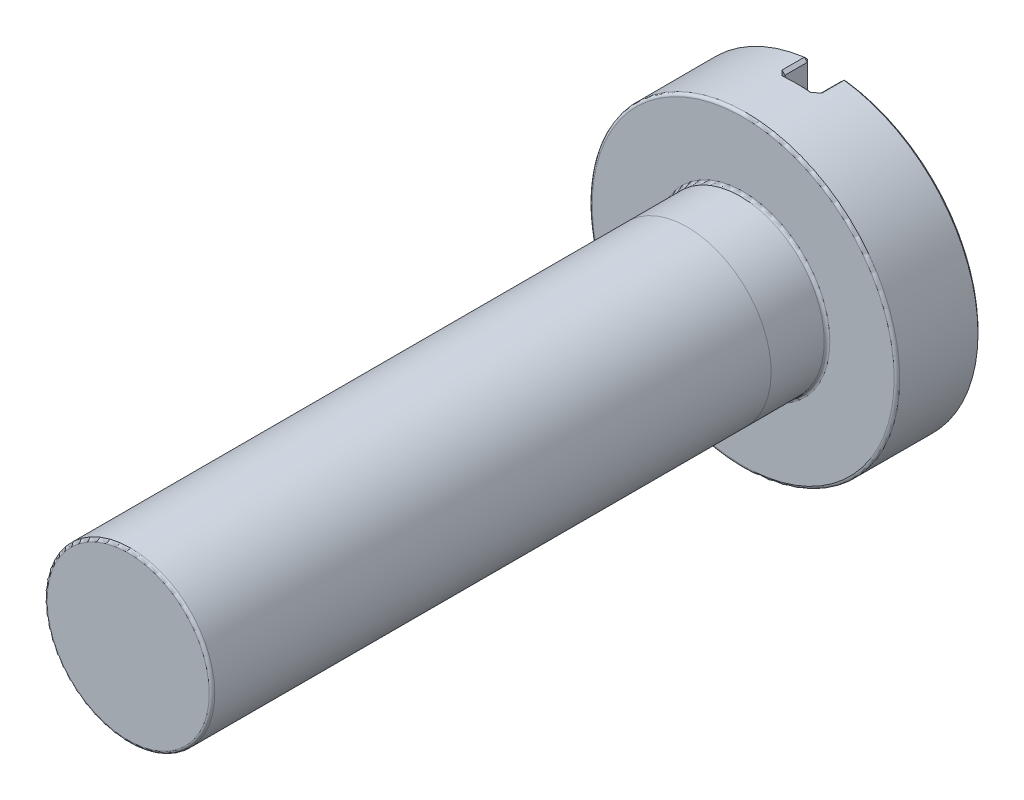
ISO-10303-21;
HEADER;
FILE_DESCRIPTION(('STEP AP214'),'2;1');
FILE_NAME('part.step','',(''),(''),'','','');
FILE_SCHEMA(('AUTOMOTIVE_DESIGN { 1 0 10303 214 1 1 1 1 }'));
ENDSEC;
DATA;
#1=APPLICATION_CONTEXT('core data for automotive mechanical design processes');
#2=APPLICATION_PROTOCOL_DEFINITION('international standard','automotive_design',2000,#1);
#3=PRODUCT_CONTEXT('',#1,'mechanical');
#4=PRODUCT('Part','Part','',(#3));
#5=PRODUCT_RELATED_PRODUCT_CATEGORY('part','',(#4));
#6=PRODUCT_DEFINITION_FORMATION('','',#4);
#7=PRODUCT_DEFINITION_CONTEXT('part definition',#1,'design');
#8=PRODUCT_DEFINITION('design','',#6,#7);
#9=PRODUCT_DEFINITION_SHAPE('','',#8);
#10=(LENGTH_UNIT() NAMED_UNIT(*) SI_UNIT(.MILLI.,.METRE.));
#11=(NAMED_UNIT(*) PLANE_ANGLE_UNIT() SI_UNIT($,.RADIAN.));
#12=(NAMED_UNIT(*) SI_UNIT($,.STERADIAN.) SOLID_ANGLE_UNIT());
#13=UNCERTAINTY_MEASURE_WITH_UNIT(LENGTH_MEASURE(1.E-05),#10,'distance_accuracy_value','');
#14=(GEOMETRIC_REPRESENTATION_CONTEXT(3) GLOBAL_UNCERTAINTY_ASSIGNED_CONTEXT((#13)) GLOBAL_UNIT_ASSIGNED_CONTEXT((#10,
#11,#12)) REPRESENTATION_CONTEXT('',''));
#15=CARTESIAN_POINT('',(0.,0.,0.));
#16=DIRECTION('',(0.,0.,1.));
#17=DIRECTION('',(1.,0.,0.));
#18=AXIS2_PLACEMENT_3D('',#15,#16,#17);
#19=CARTESIAN_POINT('',(0.,0.,11.));
#20=DIRECTION('',(0.,0.,-1.));
#21=DIRECTION('',(-1.,0.,0.));
#22=AXIS2_PLACEMENT_3D('',#19,#20,#21);
#23=CYLINDRICAL_SURFACE('',#22,1.5);
#24=CARTESIAN_POINT('',(0.,0.,10.95));
#25=DIRECTION('',(0.,0.,1.));
#26=DIRECTION('',(1.,0.,0.));
#27=AXIS2_PLACEMENT_3D('',#24,#25,#26);
#28=CIRCLE('',#27,1.5);
#29=CARTESIAN_POINT('',(1.5,0.,10.95));
#30=VERTEX_POINT('',#29);
#31=EDGE_CURVE('E55',#30,#30,#28,.F.);
#32=ORIENTED_EDGE('',*,*,#31,.T.);
#33=EDGE_LOOP('',(#32));
#34=FACE_BOUND('',#33,.T.);
#35=CARTESIAN_POINT('',(0.,0.,0.999999999999999));
#36=DIRECTION('',(0.,0.,-1.));
#37=DIRECTION('',(0.,1.,0.));
#38=AXIS2_PLACEMENT_3D('',#35,#36,#37);
#39=CIRCLE('',#38,1.5);
#40=CARTESIAN_POINT('',(0.,1.5,0.999999999999999));
#41=VERTEX_POINT('',#40);
#42=EDGE_CURVE('E11',#41,#41,#39,.T.);
#43=ORIENTED_EDGE('',*,*,#42,.F.);
#44=EDGE_LOOP('',(#43));
#45=FACE_BOUND('',#44,.T.);
#46=ADVANCED_FACE('F46',(#34,#45),#23,.T.);
#47=CARTESIAN_POINT('',(0.,0.,-1.5));
#48=DIRECTION('',(0.,0.,1.));
#49=DIRECTION('',(1.,0.,0.));
#50=AXIS2_PLACEMENT_3D('',#47,#48,#49);
#51=CYLINDRICAL_SURFACE('',#50,2.75);
#52=CARTESIAN_POINT('',(0.,0.,-0.0499999999999999));
#53=DIRECTION('',(0.,0.,1.));
#54=DIRECTION('',(1.,0.,0.));
#55=AXIS2_PLACEMENT_3D('',#52,#53,#54);
#56=CIRCLE('',#55,2.75);
#57=CARTESIAN_POINT('',(2.75,0.,-0.0499999999999999));
#58=VERTEX_POINT('',#57);
#59=EDGE_CURVE('E514',#58,#58,#56,.F.);
#60=ORIENTED_EDGE('',*,*,#59,.T.);
#61=EDGE_LOOP('',(#60));
#62=FACE_BOUND('',#61,.T.);
#63=CARTESIAN_POINT('',(-0.356481481481481,2.72679683023154,-1.05));
#64=CARTESIAN_POINT('',(-0.347664395842464,2.72794946380014,-1.04117807206455));
#65=CARTESIAN_POINT('',(-0.33882512364023,2.7290615860206,-1.03237298581949));
#66=CARTESIAN_POINT('',(-0.321099028338335,2.73120398569253,-1.01480079977808));
#67=CARTESIAN_POINT('',(-0.312212205212935,2.73223426309969,-1.0060337000023));
#68=CARTESIAN_POINT('',(-0.287162841256095,2.73501387422917,-0.981451563587695));
#69=CARTESIAN_POINT('',(-0.270942516358507,2.73666902458201,-0.965684718089823));
#70=CARTESIAN_POINT('',(-0.254629629631047,2.7381862156752,-0.950000000001396));
#71=B_SPLINE_CURVE_WITH_KNOTS('',3,(#63,#64,#65,#66,#67,#68,#69,#70),.UNSPECIFIED.,.F.,.F.,(4,2,
2,4),(0.,0.0375773794297736,0.0751547792021277,0.1431957218944),.UNSPECIFIED.);
#72=CARTESIAN_POINT('',(-0.356481481481481,2.72679683023154,-1.05));
#73=VERTEX_POINT('',#72);
#74=CARTESIAN_POINT('',(-0.254629629629628,2.73818621567538,-0.95));
#75=VERTEX_POINT('',#74);
#76=EDGE_CURVE('E261',#73,#75,#71,.T.);
#77=ORIENTED_EDGE('',*,*,#76,.F.);
#78=DIRECTION('',(0.,0.,1.));
#79=VECTOR('',#78,1.);
#80=CARTESIAN_POINT('',(-0.356481481481481,2.72679683023154,-1.5));
#81=LINE('',#80,#79);
#82=CARTESIAN_POINT('',(-0.356481481481481,2.72679683023154,-1.45));
#83=VERTEX_POINT('',#82);
#84=EDGE_CURVE('E259',#73,#83,#81,.F.);
#85=ORIENTED_EDGE('',*,*,#84,.T.);
#86=CARTESIAN_POINT('',(0.,0.,-1.45));
#87=DIRECTION('',(0.,0.,1.));
#88=DIRECTION('',(1.,0.,0.));
#89=AXIS2_PLACEMENT_3D('',#86,#87,#88);
#90=CIRCLE('',#89,2.75);
#91=CARTESIAN_POINT('',(-0.356481481481481,-2.72679683023154,-1.45));
#92=VERTEX_POINT('',#91);
#93=EDGE_CURVE('E255',#83,#92,#90,.T.);
#94=ORIENTED_EDGE('',*,*,#93,.T.);
#95=DIRECTION('',(0.,0.,1.));
#96=VECTOR('',#95,1.);
#97=CARTESIAN_POINT('',(-0.356481481481481,-2.72679683023154,-1.5));
#98=LINE('',#97,#96);
#99=CARTESIAN_POINT('',(-0.356481481481481,-2.72679683023154,-1.05));
#100=VERTEX_POINT('',#99);
#101=EDGE_CURVE('E155',#92,#100,#98,.T.);
#102=ORIENTED_EDGE('',*,*,#101,.T.);
#103=CARTESIAN_POINT('',(-0.254629629629628,-2.73818621567538,-0.95));
#104=CARTESIAN_POINT('',(-0.263638943794522,-2.73734837041018,-0.958661912495163));
#105=CARTESIAN_POINT('',(-0.272619899169562,-2.73646840241964,-0.967349125297718));
#106=CARTESIAN_POINT('',(-0.290528422567071,-2.73462508679492,-0.984769605017457));
#107=CARTESIAN_POINT('',(-0.29945599063411,-2.73366173923036,-0.993502871896181));
#108=CARTESIAN_POINT('',(-0.32447825011662,-2.7308381100455,-1.01810769091684));
#109=CARTESIAN_POINT('',(-0.340515929031501,-2.728883819563,-1.034026548804));
#110=CARTESIAN_POINT('',(-0.356481481481481,-2.72679683023154,-1.05));
#111=B_SPLINE_CURVE_WITH_KNOTS('',3,(#103,#104,#105,#106,#107,#108,#109,#110),.UNSPECIFIED.,.F.,
.F.,(4,2,2,4),(0.,0.0375774596881583,0.075154888000334,0.14319579112404),.UNSPECIFIED.);
#112=CARTESIAN_POINT('',(-0.254629629629628,-2.73818621567538,-0.95));
#113=VERTEX_POINT('',#112);
#114=EDGE_CURVE('E247',#113,#100,#111,.T.);
#115=ORIENTED_EDGE('',*,*,#114,.F.);
#116=CARTESIAN_POINT('',(0.,0.,-0.95));
#117=DIRECTION('',(0.,0.,-1.));
#118=DIRECTION('',(-1.,0.,0.));
#119=AXIS2_PLACEMENT_3D('',#116,#117,#118);
#120=CIRCLE('',#119,2.75);
#121=CARTESIAN_POINT('',(0.254629629629628,-2.73818621567538,-0.95));
#122=VERTEX_POINT('',#121);
#123=EDGE_CURVE('E203',#113,#122,#120,.F.);
#124=ORIENTED_EDGE('',*,*,#123,.T.);
#125=CARTESIAN_POINT('',(0.356481481481481,-2.72679683023154,-1.05));
#126=CARTESIAN_POINT('',(0.347664395842464,-2.72794946380014,-1.04117807206455));
#127=CARTESIAN_POINT('',(0.33882512364023,-2.7290615860206,-1.03237298581949));
#128=CARTESIAN_POINT('',(0.321099028338335,-2.73120398569253,-1.01480079977808));
#129=CARTESIAN_POINT('',(0.312212205212935,-2.73223426309969,-1.0060337000023));
#130=CARTESIAN_POINT('',(0.287162841256095,-2.73501387422917,-0.981451563587695));
#131=CARTESIAN_POINT('',(0.270942516358507,-2.73666902458201,-0.965684718089823));
#132=CARTESIAN_POINT('',(0.254629629631047,-2.7381862156752,-0.950000000001396));
#133=B_SPLINE_CURVE_WITH_KNOTS('',3,(#125,#126,#127,#128,#129,#130,#131,#132),.UNSPECIFIED.,.F.,
.F.,(4,2,2,4),(0.,0.0375773794297736,0.0751547792021277,0.1431957218944),.UNSPECIFIED.);
#134=CARTESIAN_POINT('',(0.356481481481481,-2.72679683023154,-1.05));
#135=VERTEX_POINT('',#134);
#136=EDGE_CURVE('E194',#135,#122,#133,.T.);
#137=ORIENTED_EDGE('',*,*,#136,.F.);
#138=DIRECTION('',(0.,0.,1.));
#139=VECTOR('',#138,1.);
#140=CARTESIAN_POINT('',(0.356481481481481,-2.72679683023154,-1.5));
#141=LINE('',#140,#139);
#142=CARTESIAN_POINT('',(0.356481481481481,-2.72679683023154,-1.45));
#143=VERTEX_POINT('',#142);
#144=EDGE_CURVE('E192',#135,#143,#141,.F.);
#145=ORIENTED_EDGE('',*,*,#144,.T.);
#146=CARTESIAN_POINT('',(0.,0.,-1.45));
#147=DIRECTION('',(0.,0.,1.));
#148=DIRECTION('',(1.,0.,0.));
#149=AXIS2_PLACEMENT_3D('',#146,#147,#148);
#150=CIRCLE('',#149,2.75);
#151=CARTESIAN_POINT('',(0.356481481481483,2.72679683023154,-1.45));
#152=VERTEX_POINT('',#151);
#153=EDGE_CURVE('E185',#143,#152,#150,.T.);
#154=ORIENTED_EDGE('',*,*,#153,.T.);
#155=DIRECTION('',(0.,0.,1.));
#156=VECTOR('',#155,1.);
#157=CARTESIAN_POINT('',(0.356481481481483,2.72679683023154,-1.5));
#158=LINE('',#157,#156);
#159=CARTESIAN_POINT('',(0.356481481481483,2.72679683023154,-1.05));
#160=VERTEX_POINT('',#159);
#161=EDGE_CURVE('E190',#152,#160,#158,.T.);
#162=ORIENTED_EDGE('',*,*,#161,.T.);
#163=CARTESIAN_POINT('',(0.254629629629628,2.73818621567538,-0.95));
#164=CARTESIAN_POINT('',(0.263638943794522,2.73734837041018,-0.958661912495163));
#165=CARTESIAN_POINT('',(0.272619899169563,2.73646840241964,-0.967349125297718));
#166=CARTESIAN_POINT('',(0.290528422567072,2.73462508679492,-0.984769605017457));
#167=CARTESIAN_POINT('',(0.299455990634111,2.73366173923036,-0.99350287189618));
#168=CARTESIAN_POINT('',(0.32447825011662,2.73083811004549,-1.01810769091684));
#169=CARTESIAN_POINT('',(0.340515929031501,2.72888381956299,-1.034026548804));
#170=CARTESIAN_POINT('',(0.356481481481483,2.72679683023154,-1.05));
#171=B_SPLINE_CURVE_WITH_KNOTS('',3,(#163,#164,#165,#166,#167,#168,#169,#170),.UNSPECIFIED.,.F.,
.F.,(4,2,2,4),(0.,0.0375774596881585,0.075154888000334,0.143195791124041),.UNSPECIFIED.);
#172=CARTESIAN_POINT('',(0.254629629629628,2.73818621567538,-0.95));
#173=VERTEX_POINT('',#172);
#174=EDGE_CURVE('E240',#173,#160,#171,.T.);
#175=ORIENTED_EDGE('',*,*,#174,.F.);
#176=CARTESIAN_POINT('',(0.,0.,-0.95));
#177=DIRECTION('',(0.,0.,-1.));
#178=DIRECTION('',(-1.,0.,0.));
#179=AXIS2_PLACEMENT_3D('',#176,#177,#178);
#180=CIRCLE('',#179,2.75);
#181=EDGE_CURVE('E257',#173,#75,#180,.F.);
#182=ORIENTED_EDGE('',*,*,#181,.T.);
#183=EDGE_LOOP('',(#77,#85,#94,#102,#115,#124,#137,#145,#154,#162,#175,#182));
#184=FACE_BOUND('',#183,.T.);
#185=ADVANCED_FACE('F205',(#62,#184),#51,.T.);
#186=CARTESIAN_POINT('',(0.,0.,-1.5));
#187=DIRECTION('',(0.,0.,1.));
#188=DIRECTION('',(1.,0.,0.));
#189=AXIS2_PLACEMENT_3D('',#186,#187,#188);
#190=PLANE('',#189);
#191=CARTESIAN_POINT('',(0.,0.,-1.5));
#192=DIRECTION('',(0.,0.,1.));
#193=DIRECTION('',(1.,0.,0.));
#194=AXIS2_PLACEMENT_3D('',#191,#192,#193);
#195=CIRCLE('',#194,2.7);
#196=CARTESIAN_POINT('',(0.35,2.67721870604551,-1.5));
#197=VERTEX_POINT('',#196);
#198=CARTESIAN_POINT('',(0.35,-2.67721870604551,-1.5));
#199=VERTEX_POINT('',#198);
#200=EDGE_CURVE('E61',#197,#199,#195,.F.);
#201=ORIENTED_EDGE('',*,*,#200,.T.);
#202=DIRECTION('',(0.,1.,0.));
#203=VECTOR('',#202,1.);
#204=CARTESIAN_POINT('',(0.35,0.,-1.5));
#205=LINE('',#204,#203);
#206=EDGE_CURVE('E530',#199,#197,#205,.T.);
#207=ORIENTED_EDGE('',*,*,#206,.T.);
#208=EDGE_LOOP('',(#201,#207));
#209=FACE_BOUND('',#208,.T.);
#210=ADVANCED_FACE('F494',(#209),#190,.F.);
#211=ORIENTED_EDGE('',*,*,#42,.T.);
#212=EDGE_LOOP('',(#211));
#213=FACE_BOUND('',#212,.T.);
#214=CARTESIAN_POINT('',(0.,0.,0.0499999999999997));
#215=DIRECTION('',(0.,0.,1.));
#216=DIRECTION('',(1.,0.,0.));
#217=AXIS2_PLACEMENT_3D('',#214,#215,#216);
#218=CIRCLE('',#217,1.5);
#219=CARTESIAN_POINT('',(1.5,0.,0.0499999999999997));
#220=VERTEX_POINT('',#219);
#221=EDGE_CURVE('E512',#220,#220,#218,.T.);
#222=ORIENTED_EDGE('',*,*,#221,.T.);
#223=EDGE_LOOP('',(#222));
#224=FACE_BOUND('',#223,.T.);
#225=ADVANCED_FACE('F218',(#213,#224),#23,.T.);
#226=CARTESIAN_POINT('',(0.,0.,11.));
#227=DIRECTION('',(0.,0.,1.));
#228=DIRECTION('',(1.,0.,0.));
#229=AXIS2_PLACEMENT_3D('',#226,#227,#228);
#230=PLANE('',#229);
#231=CARTESIAN_POINT('',(0.,0.,11.));
#232=DIRECTION('',(0.,0.,1.));
#233=DIRECTION('',(1.,0.,0.));
#234=AXIS2_PLACEMENT_3D('',#231,#232,#233);
#235=CIRCLE('',#234,1.45);
#236=CARTESIAN_POINT('',(1.45,0.,11.));
#237=VERTEX_POINT('',#236);
#238=EDGE_CURVE('E513',#237,#237,#235,.T.);
#239=ORIENTED_EDGE('',*,*,#238,.T.);
#240=EDGE_LOOP('',(#239));
#241=FACE_BOUND('',#240,.T.);
#242=ADVANCED_FACE('F499',(#241),#230,.T.);
#243=CARTESIAN_POINT('',(0.,0.,-1.5));
#244=DIRECTION('',(0.,0.,1.));
#245=DIRECTION('',(1.,0.,0.));
#246=AXIS2_PLACEMENT_3D('',#243,#244,#245);
#247=CIRCLE('',#246,2.7);
#248=CARTESIAN_POINT('',(-0.35,-2.67721870604551,-1.5));
#249=VERTEX_POINT('',#248);
#250=CARTESIAN_POINT('',(-0.35,2.67721870604551,-1.5));
#251=VERTEX_POINT('',#250);
#252=EDGE_CURVE('E593',#249,#251,#247,.F.);
#253=ORIENTED_EDGE('',*,*,#252,.T.);
#254=DIRECTION('',(0.,-1.,0.));
#255=VECTOR('',#254,1.);
#256=CARTESIAN_POINT('',(-0.35,0.,-1.5));
#257=LINE('',#256,#255);
#258=EDGE_CURVE('E600',#251,#249,#257,.T.);
#259=ORIENTED_EDGE('',*,*,#258,.T.);
#260=EDGE_LOOP('',(#253,#259));
#261=FACE_BOUND('',#260,.T.);
#262=ADVANCED_FACE('F505',(#261),#190,.F.);
#263=CARTESIAN_POINT('',(0.,0.,0.));
#264=DIRECTION('',(0.,0.,1.));
#265=DIRECTION('',(1.,0.,0.));
#266=AXIS2_PLACEMENT_3D('',#263,#264,#265);
#267=PLANE('',#266);
#268=CARTESIAN_POINT('',(0.,0.,0.));
#269=DIRECTION('',(0.,0.,1.));
#270=DIRECTION('',(1.,0.,0.));
#271=AXIS2_PLACEMENT_3D('',#268,#269,#270);
#272=CIRCLE('',#271,2.7);
#273=CARTESIAN_POINT('',(2.7,0.,0.));
#274=VERTEX_POINT('',#273);
#275=EDGE_CURVE('E519',#274,#274,#272,.T.);
#276=ORIENTED_EDGE('',*,*,#275,.T.);
#277=EDGE_LOOP('',(#276));
#278=FACE_BOUND('',#277,.T.);
#279=CARTESIAN_POINT('',(0.,0.,0.));
#280=DIRECTION('',(0.,0.,1.));
#281=DIRECTION('',(1.,0.,0.));
#282=AXIS2_PLACEMENT_3D('',#279,#280,#281);
#283=CIRCLE('',#282,1.55);
#284=CARTESIAN_POINT('',(1.55,0.,0.));
#285=VERTEX_POINT('',#284);
#286=EDGE_CURVE('E527',#285,#285,#283,.F.);
#287=ORIENTED_EDGE('',*,*,#286,.T.);
#288=EDGE_LOOP('',(#287));
#289=FACE_BOUND('',#288,.T.);
#290=ADVANCED_FACE('F617',(#278,#289),#267,.T.);
#291=CARTESIAN_POINT('',(0.3,-3.72872824867462,-1.));
#292=DIRECTION('',(1.,0.,0.));
#293=DIRECTION('',(0.,0.,-1.));
#294=AXIS2_PLACEMENT_3D('',#291,#292,#293);
#295=PLANE('',#294);
#296=DIRECTION('',(0.,0.,1.));
#297=VECTOR('',#296,1.);
#298=CARTESIAN_POINT('',(0.3,-2.67721870604551,-1.));
#299=LINE('',#298,#297);
#300=CARTESIAN_POINT('',(0.3,-2.67721870604551,-1.45));
#301=VERTEX_POINT('',#300);
#302=CARTESIAN_POINT('',(0.3,-2.67721870604551,-1.05));
#303=VERTEX_POINT('',#302);
#304=EDGE_CURVE('E554',#301,#303,#299,.T.);
#305=ORIENTED_EDGE('',*,*,#304,.T.);
#306=DIRECTION('',(0.,1.,0.));
#307=VECTOR('',#306,1.);
#308=CARTESIAN_POINT('',(0.3,-3.72872824867462,-1.05));
#309=LINE('',#308,#307);
#310=CARTESIAN_POINT('',(0.3,2.67721870604551,-1.05));
#311=VERTEX_POINT('',#310);
#312=EDGE_CURVE('E955',#303,#311,#309,.T.);
#313=ORIENTED_EDGE('',*,*,#312,.T.);
#314=DIRECTION('',(0.,0.,-1.));
#315=VECTOR('',#314,1.);
#316=CARTESIAN_POINT('',(0.3,2.67721870604551,-1.5));
#317=LINE('',#316,#315);
#318=CARTESIAN_POINT('',(0.3,2.67721870604551,-1.45));
#319=VERTEX_POINT('',#318);
#320=EDGE_CURVE('E958',#311,#319,#317,.T.);
#321=ORIENTED_EDGE('',*,*,#320,.T.);
#322=DIRECTION('',(0.,-1.,0.));
#323=VECTOR('',#322,1.);
#324=CARTESIAN_POINT('',(0.3,-3.72872824867462,-1.45));
#325=LINE('',#324,#323);
#326=EDGE_CURVE('E268',#319,#301,#325,.T.);
#327=ORIENTED_EDGE('',*,*,#326,.T.);
#328=EDGE_LOOP('',(#305,#313,#321,#327));
#329=FACE_BOUND('',#328,.T.);
#330=ADVANCED_FACE('F621',(#329),#295,.F.);
#331=CARTESIAN_POINT('',(-0.3,-3.72872824867462,-1.));
#332=DIRECTION('',(-1.,0.,0.));
#333=DIRECTION('',(0.,0.,1.));
#334=AXIS2_PLACEMENT_3D('',#331,#332,#333);
#335=PLANE('',#334);
#336=DIRECTION('',(0.,0.,1.));
#337=VECTOR('',#336,1.);
#338=CARTESIAN_POINT('',(-0.3,2.67721870604551,-1.));
#339=LINE('',#338,#337);
#340=CARTESIAN_POINT('',(-0.3,2.67721870604551,-1.45));
#341=VERTEX_POINT('',#340);
#342=CARTESIAN_POINT('',(-0.3,2.67721870604551,-1.05));
#343=VERTEX_POINT('',#342);
#344=EDGE_CURVE('E177',#341,#343,#339,.T.);
#345=ORIENTED_EDGE('',*,*,#344,.T.);
#346=DIRECTION('',(0.,-1.,0.));
#347=VECTOR('',#346,1.);
#348=CARTESIAN_POINT('',(-0.3,-3.72872824867462,-1.05));
#349=LINE('',#348,#347);
#350=CARTESIAN_POINT('',(-0.3,-2.67721870604551,-1.05));
#351=VERTEX_POINT('',#350);
#352=EDGE_CURVE('E182',#343,#351,#349,.T.);
#353=ORIENTED_EDGE('',*,*,#352,.T.);
#354=DIRECTION('',(0.,0.,-1.));
#355=VECTOR('',#354,1.);
#356=CARTESIAN_POINT('',(-0.3,-2.67721870604551,-1.5));
#357=LINE('',#356,#355);
#358=CARTESIAN_POINT('',(-0.3,-2.67721870604551,-1.45));
#359=VERTEX_POINT('',#358);
#360=EDGE_CURVE('E153',#351,#359,#357,.T.);
#361=ORIENTED_EDGE('',*,*,#360,.T.);
#362=DIRECTION('',(0.,1.,0.));
#363=VECTOR('',#362,1.);
#364=CARTESIAN_POINT('',(-0.3,-3.72872824867462,-1.45));
#365=LINE('',#364,#363);
#366=EDGE_CURVE('E171',#359,#341,#365,.T.);
#367=ORIENTED_EDGE('',*,*,#366,.T.);
#368=EDGE_LOOP('',(#345,#353,#361,#367));
#369=FACE_BOUND('',#368,.T.);
#370=ADVANCED_FACE('F180',(#369),#335,.F.);
#371=CARTESIAN_POINT('',(0.,0.,-1.));
#372=DIRECTION('',(0.,0.,-1.));
#373=DIRECTION('',(-1.,0.,0.));
#374=AXIS2_PLACEMENT_3D('',#371,#372,#373);
#375=PLANE('',#374);
#376=DIRECTION('',(0.,-1.,0.));
#377=VECTOR('',#376,1.);
#378=CARTESIAN_POINT('',(0.249999999999999,0.,-1.));
#379=LINE('',#378,#377);
#380=CARTESIAN_POINT('',(0.249999999999998,2.68840101175401,-1.));
#381=VERTEX_POINT('',#380);
#382=CARTESIAN_POINT('',(0.249999999999999,-2.68840101175401,-1.));
#383=VERTEX_POINT('',#382);
#384=EDGE_CURVE('E590',#381,#383,#379,.T.);
#385=ORIENTED_EDGE('',*,*,#384,.T.);
#386=CARTESIAN_POINT('',(0.,0.,-1.));
#387=DIRECTION('',(0.,0.,-1.));
#388=DIRECTION('',(-1.,0.,0.));
#389=AXIS2_PLACEMENT_3D('',#386,#387,#388);
#390=CIRCLE('',#389,2.7);
#391=CARTESIAN_POINT('',(-0.249999999999999,-2.68840101175401,-1.));
#392=VERTEX_POINT('',#391);
#393=EDGE_CURVE('E569',#383,#392,#390,.T.);
#394=ORIENTED_EDGE('',*,*,#393,.T.);
#395=DIRECTION('',(0.,1.,0.));
#396=VECTOR('',#395,1.);
#397=CARTESIAN_POINT('',(-0.249999999999999,0.,-1.));
#398=LINE('',#397,#396);
#399=CARTESIAN_POINT('',(-0.249999999999999,2.68840101175401,-1.));
#400=VERTEX_POINT('',#399);
#401=EDGE_CURVE('E595',#392,#400,#398,.T.);
#402=ORIENTED_EDGE('',*,*,#401,.T.);
#403=CARTESIAN_POINT('',(0.,0.,-1.));
#404=DIRECTION('',(0.,0.,-1.));
#405=DIRECTION('',(-1.,0.,0.));
#406=AXIS2_PLACEMENT_3D('',#403,#404,#405);
#407=CIRCLE('',#406,2.7);
#408=EDGE_CURVE('E587',#400,#381,#407,.T.);
#409=ORIENTED_EDGE('',*,*,#408,.T.);
#410=EDGE_LOOP('',(#385,#394,#402,#409));
#411=FACE_BOUND('',#410,.T.);
#412=ADVANCED_FACE('F476',(#411),#375,.T.);
#413=CARTESIAN_POINT('',(0.3,2.67721870604551,-1.45));
#414=DIRECTION('',(-0.550659428732137,0.627334350324276,-0.550659428732147));
#415=DIRECTION('',(0.,0.659685671502104,0.751541625470485));
#416=AXIS2_PLACEMENT_3D('',#413,#414,#415);
#417=PLANE('',#416);
#418=DIRECTION('',(0.75154162547049,0.659685671502097,0.));
#419=VECTOR('',#418,1.);
#420=CARTESIAN_POINT('',(0.3,2.67721870604551,-1.45));
#421=LINE('',#420,#419);
#422=EDGE_CURVE('E535',#152,#319,#421,.F.);
#423=ORIENTED_EDGE('',*,*,#422,.F.);
#424=DIRECTION('',(-0.0916619901538293,-0.701140556208987,-0.707106781186542));
#425=VECTOR('',#424,1.);
#426=CARTESIAN_POINT('',(0.,0.,-4.19999999999998));
#427=LINE('',#426,#425);
#428=EDGE_CURVE('E178',#197,#152,#427,.F.);
#429=ORIENTED_EDGE('',*,*,#428,.F.);
#430=DIRECTION('',(0.707106781186554,0.,-0.707106781186541));
#431=VECTOR('',#430,1.);
#432=CARTESIAN_POINT('',(0.3,2.67721870604551,-1.45));
#433=LINE('',#432,#431);
#434=EDGE_CURVE('E532',#319,#197,#433,.T.);
#435=ORIENTED_EDGE('',*,*,#434,.F.);
#436=EDGE_LOOP('',(#423,#429,#435));
#437=FACE_BOUND('',#436,.T.);
#438=ADVANCED_FACE('F471',(#437),#417,.T.);
#439=CARTESIAN_POINT('',(0.,0.,-1.45));
#440=DIRECTION('',(0.,0.,1.));
#441=DIRECTION('',(1.,0.,0.));
#442=AXIS2_PLACEMENT_3D('',#439,#440,#441);
#443=CONICAL_SURFACE('',#442,2.75,0.785398163397457);
#444=ORIENTED_EDGE('',*,*,#428,.T.);
#445=ORIENTED_EDGE('',*,*,#153,.F.);
#446=DIRECTION('',(0.0916619901538038,-0.70114055620899,0.707106781186541));
#447=VECTOR('',#446,1.);
#448=CARTESIAN_POINT('',(0.,0.,-4.19999999999994));
#449=LINE('',#448,#447);
#450=EDGE_CURVE('E538',#199,#143,#449,.T.);
#451=ORIENTED_EDGE('',*,*,#450,.F.);
#452=ORIENTED_EDGE('',*,*,#200,.F.);
#453=EDGE_LOOP('',(#444,#445,#451,#452));
#454=FACE_BOUND('',#453,.T.);
#455=ADVANCED_FACE('F465',(#454),#443,.T.);
#456=CARTESIAN_POINT('',(0.35,0.,-1.5));
#457=DIRECTION('',(0.707106781186541,0.,0.707106781186554));
#458=DIRECTION('',(0.,1.,0.));
#459=AXIS2_PLACEMENT_3D('',#456,#457,#458);
#460=PLANE('',#459);
#461=ORIENTED_EDGE('',*,*,#434,.T.);
#462=ORIENTED_EDGE('',*,*,#206,.F.);
#463=DIRECTION('',(-0.707106781186554,0.,0.707106781186541));
#464=VECTOR('',#463,1.);
#465=CARTESIAN_POINT('',(0.328240740740741,-2.67721870604551,-1.47824074074074));
#466=LINE('',#465,#464);
#467=EDGE_CURVE('E541',#301,#199,#466,.F.);
#468=ORIENTED_EDGE('',*,*,#467,.F.);
#469=ORIENTED_EDGE('',*,*,#326,.F.);
#470=EDGE_LOOP('',(#461,#462,#468,#469));
#471=FACE_BOUND('',#470,.T.);
#472=ADVANCED_FACE('F458',(#471),#460,.F.);
#473=CARTESIAN_POINT('',(0.3,2.67721870604551,-1.5));
#474=DIRECTION('',(-0.659685671502097,0.75154162547049,0.));
#475=DIRECTION('',(0.,0.,1.));
#476=AXIS2_PLACEMENT_3D('',#473,#474,#475);
#477=PLANE('',#476);
#478=ORIENTED_EDGE('',*,*,#422,.T.);
#479=ORIENTED_EDGE('',*,*,#320,.F.);
#480=DIRECTION('',(-0.75154162547049,-0.659685671502097,0.));
#481=VECTOR('',#480,1.);
#482=CARTESIAN_POINT('',(0.356481481481483,2.72679683023154,-1.05));
#483=LINE('',#482,#481);
#484=EDGE_CURVE('E543',#160,#311,#483,.T.);
#485=ORIENTED_EDGE('',*,*,#484,.F.);
#486=ORIENTED_EDGE('',*,*,#161,.F.);
#487=EDGE_LOOP('',(#478,#479,#485,#486));
#488=FACE_BOUND('',#487,.T.);
#489=ADVANCED_FACE('F451',(#488),#477,.T.);
#490=CARTESIAN_POINT('',(0.356481481481481,-2.72679683023154,-1.45));
#491=DIRECTION('',(-0.550659428732152,-0.627334350324259,-0.550659428732151));
#492=DIRECTION('',(0.751541625470473,-0.659685671502118,0.));
#493=AXIS2_PLACEMENT_3D('',#490,#491,#492);
#494=PLANE('',#493);
#495=ORIENTED_EDGE('',*,*,#467,.T.);
#496=ORIENTED_EDGE('',*,*,#450,.T.);
#497=DIRECTION('',(0.751541625470473,-0.659685671502117,0.));
#498=VECTOR('',#497,1.);
#499=CARTESIAN_POINT('',(0.356481481481481,-2.72679683023154,-1.45));
#500=LINE('',#499,#498);
#501=EDGE_CURVE('E406',#301,#143,#500,.T.);
#502=ORIENTED_EDGE('',*,*,#501,.F.);
#503=EDGE_LOOP('',(#495,#496,#502));
#504=FACE_BOUND('',#503,.T.);
#505=ADVANCED_FACE('F439',(#504),#494,.T.);
#506=CARTESIAN_POINT('',(0.249999999999998,2.68840101175401,-1.));
#507=CARTESIAN_POINT('',(0.3,2.67721870604551,-1.05));
#508=CARTESIAN_POINT('',(0.254629629629628,2.73818621567538,-0.95));
#509=CARTESIAN_POINT('',(0.356481481481483,2.72679683023154,-1.05));
#510=CARTESIAN_POINT('',(0.254700493957951,2.73894826260323,-0.949234665254114));
#511=CARTESIAN_POINT('',(0.357346026287021,2.72755570745305,-1.05));
#512=B_SPLINE_SURFACE_WITH_KNOTS('',1,1,((#506,#507),(#508,#509),(#510,#511)),.UNSPECIFIED.,.F.,
.F.,.F.,(2,1,2),(2,2),(0.,1.,1.01530669491773),(0.,1.),.UNSPECIFIED.);
#513=CARTESIAN_POINT('',(0.3,2.67721870604551,-1.05));
#514=CARTESIAN_POINT('',(0.295625856762105,2.67819696618349,-1.0456258567621));
#515=CARTESIAN_POINT('',(0.291251713524209,2.67917522632147,-1.04125171352421));
#516=CARTESIAN_POINT('',(0.282503427048418,2.68113174659742,-1.03250342704842));
#517=CARTESIAN_POINT('',(0.278129283810523,2.6821100067354,-1.02812928381052));
#518=CARTESIAN_POINT('',(0.265836760381751,2.68485918183359,-1.01583676038175));
#519=CARTESIAN_POINT('',(0.257918380190875,2.6866300967938,-1.00791838019088));
#520=CARTESIAN_POINT('',(0.249999999999998,2.68840101175401,-1.));
#521=B_SPLINE_CURVE_WITH_KNOTS('',3,(#513,#514,#515,#516,#517,#518,#519,#520),.UNSPECIFIED.,.F.,
.F.,(4,2,2,4),(0.,0.0187885406367622,0.0375770812735245,0.0715894123523757),.UNSPECIFIED.);
#522=EDGE_CURVE('E397',#381,#311,#521,.F.);
#523=DIRECTION('',(0.0654728501098666,0.704069105911138,0.707106781186535));
#524=VECTOR('',#523,1.);
#525=CARTESIAN_POINT('',(0.249999999999998,2.68840101175401,-1.));
#526=LINE('',#525,#524);
#527=EDGE_CURVE('E407',#173,#381,#526,.F.);
#528=ORIENTED_EDGE('',*,*,#174,.T.);
#529=ORIENTED_EDGE('',*,*,#484,.T.);
#530=ORIENTED_EDGE('',*,*,#522,.F.);
#531=ORIENTED_EDGE('',*,*,#527,.F.);
#532=EDGE_LOOP('',(#528,#529,#530,#531));
#533=FACE_BOUND('',#532,.T.);
#534=ADVANCED_FACE('F430',(#533),#512,.T.);
#535=CARTESIAN_POINT('',(0.3,-2.67721870604551,-1.5));
#536=DIRECTION('',(0.659685671502117,0.751541625470473,0.));
#537=DIRECTION('',(0.,0.,1.));
#538=AXIS2_PLACEMENT_3D('',#535,#536,#537);
#539=PLANE('',#538);
#540=ORIENTED_EDGE('',*,*,#501,.T.);
#541=ORIENTED_EDGE('',*,*,#144,.F.);
#542=DIRECTION('',(0.751541625470473,-0.659685671502118,0.));
#543=VECTOR('',#542,1.);
#544=CARTESIAN_POINT('',(0.3,-2.67721870604551,-1.05));
#545=LINE('',#544,#543);
#546=EDGE_CURVE('E565',#303,#135,#545,.T.);
#547=ORIENTED_EDGE('',*,*,#546,.F.);
#548=ORIENTED_EDGE('',*,*,#304,.F.);
#549=EDGE_LOOP('',(#540,#541,#547,#548));
#550=FACE_BOUND('',#549,.T.);
#551=ADVANCED_FACE('F381',(#550),#539,.F.);
#552=CARTESIAN_POINT('',(0.249999999999999,0.,-1.));
#553=DIRECTION('',(0.707106781186535,0.,0.70710678118656));
#554=DIRECTION('',(0.,-1.,0.));
#555=AXIS2_PLACEMENT_3D('',#552,#553,#554);
#556=PLANE('',#555);
#557=ORIENTED_EDGE('',*,*,#522,.T.);
#558=ORIENTED_EDGE('',*,*,#312,.F.);
#559=CARTESIAN_POINT('',(0.249999999999999,-2.68840101175401,-1.));
#560=CARTESIAN_POINT('',(0.254374143237894,-2.68742275161603,-1.0043741432379));
#561=CARTESIAN_POINT('',(0.258748286475789,-2.68644449147805,-1.00874828647579));
#562=CARTESIAN_POINT('',(0.26749657295158,-2.6844879712021,-1.01749657295158));
#563=CARTESIAN_POINT('',(0.271870716189475,-2.68350971106412,-1.02187071618948));
#564=CARTESIAN_POINT('',(0.284163239618247,-2.68076053596593,-1.03416323961825));
#565=CARTESIAN_POINT('',(0.292081619809123,-2.67898962100572,-1.04208161980912));
#566=CARTESIAN_POINT('',(0.3,-2.67721870604551,-1.05));
#567=B_SPLINE_CURVE_WITH_KNOTS('',3,(#559,#560,#561,#562,#563,#564,#565,#566),.UNSPECIFIED.,.F.,
.F.,(4,2,2,4),(0.,0.0187885406367623,0.0375770812735245,0.0715894123523758),.UNSPECIFIED.);
#568=EDGE_CURVE('E389',#383,#303,#567,.T.);
#569=ORIENTED_EDGE('',*,*,#568,.F.);
#570=ORIENTED_EDGE('',*,*,#384,.F.);
#571=EDGE_LOOP('',(#557,#558,#569,#570));
#572=FACE_BOUND('',#571,.T.);
#573=ADVANCED_FACE('F368',(#572),#556,.F.);
#574=CARTESIAN_POINT('',(0.,0.,-0.95));
#575=DIRECTION('',(0.,0.,1.));
#576=DIRECTION('',(1.,0.,0.));
#577=AXIS2_PLACEMENT_3D('',#574,#575,#576);
#578=CONICAL_SURFACE('',#577,2.75,0.785398163397466);
#579=ORIENTED_EDGE('',*,*,#527,.T.);
#580=ORIENTED_EDGE('',*,*,#408,.F.);
#581=DIRECTION('',(0.0654728501098666,-0.704069105911138,-0.707106781186535));
#582=VECTOR('',#581,1.);
#583=CARTESIAN_POINT('',(-0.254629629629628,2.73818621567538,-0.95));
#584=LINE('',#583,#582);
#585=EDGE_CURVE('E576',#75,#400,#584,.T.);
#586=ORIENTED_EDGE('',*,*,#585,.F.);
#587=ORIENTED_EDGE('',*,*,#181,.F.);
#588=EDGE_LOOP('',(#579,#580,#586,#587));
#589=FACE_BOUND('',#588,.T.);
#590=ADVANCED_FACE('F380',(#589),#578,.T.);
#591=CARTESIAN_POINT('',(-0.3,2.67721870604551,-1.5));
#592=DIRECTION('',(-0.659685671502117,-0.751541625470473,0.));
#593=DIRECTION('',(0.,0.,1.));
#594=AXIS2_PLACEMENT_3D('',#591,#592,#593);
#595=PLANE('',#594);
#596=DIRECTION('',(-0.751541625470473,0.659685671502117,0.));
#597=VECTOR('',#596,1.);
#598=CARTESIAN_POINT('',(-0.356481481481481,2.72679683023154,-1.45));
#599=LINE('',#598,#597);
#600=EDGE_CURVE('E570',#83,#341,#599,.F.);
#601=ORIENTED_EDGE('',*,*,#600,.F.);
#602=ORIENTED_EDGE('',*,*,#84,.F.);
#603=DIRECTION('',(-0.751541625470473,0.659685671502118,0.));
#604=VECTOR('',#603,1.);
#605=CARTESIAN_POINT('',(-0.3,2.67721870604551,-1.05));
#606=LINE('',#605,#604);
#607=EDGE_CURVE('E572',#343,#73,#606,.T.);
#608=ORIENTED_EDGE('',*,*,#607,.F.);
#609=ORIENTED_EDGE('',*,*,#344,.F.);
#610=EDGE_LOOP('',(#601,#602,#608,#609));
#611=FACE_BOUND('',#610,.T.);
#612=ADVANCED_FACE('F672',(#611),#595,.F.);
#613=CARTESIAN_POINT('',(0.3,-2.67721870604551,-1.05));
#614=CARTESIAN_POINT('',(0.249999999999998,-2.68840101175401,-1.));
#615=CARTESIAN_POINT('',(0.356481481481481,-2.72679683023154,-1.05));
#616=CARTESIAN_POINT('',(0.254629629629628,-2.73818621567538,-0.95));
#617=CARTESIAN_POINT('',(0.35733822885105,-2.72754886304602,-1.05));
#618=CARTESIAN_POINT('',(0.254699854823855,-2.73894138960823,-0.949241567902349));
#619=B_SPLINE_SURFACE_WITH_KNOTS('',1,1,((#613,#614),(#615,#616),(#617,#618)),.UNSPECIFIED.,.F.,
.F.,.F.,(2,1,2),(2,2),(0.,1.,1.01516864195302),(0.,1.),.UNSPECIFIED.);
#620=DIRECTION('',(-0.0654728501098666,0.704069105911138,-0.707106781186535));
#621=VECTOR('',#620,1.);
#622=CARTESIAN_POINT('',(0.254629629629628,-2.73818621567538,-0.95));
#623=LINE('',#622,#621);
#624=EDGE_CURVE('E326',#383,#122,#623,.F.);
#625=ORIENTED_EDGE('',*,*,#546,.T.);
#626=ORIENTED_EDGE('',*,*,#136,.T.);
#627=ORIENTED_EDGE('',*,*,#624,.F.);
#628=ORIENTED_EDGE('',*,*,#568,.T.);
#629=EDGE_LOOP('',(#625,#626,#627,#628));
#630=FACE_BOUND('',#629,.T.);
#631=ADVANCED_FACE('F366',(#630),#619,.T.);
#632=CARTESIAN_POINT('',(-0.3,2.67721870604551,-1.05));
#633=CARTESIAN_POINT('',(-0.249999999999998,2.68840101175401,-1.));
#634=CARTESIAN_POINT('',(-0.356481481481481,2.72679683023154,-1.05));
#635=CARTESIAN_POINT('',(-0.254629629629628,2.73818621567538,-0.95));
#636=CARTESIAN_POINT('',(-0.35733822885105,2.72754886304602,-1.05));
#637=CARTESIAN_POINT('',(-0.254699854823855,2.73894138960823,-0.949241567902349));
#638=B_SPLINE_SURFACE_WITH_KNOTS('',1,1,((#632,#633),(#634,#635),(#636,#637)),.UNSPECIFIED.,.F.,
.F.,.F.,(2,1,2),(2,2),(0.,1.,1.01516864195302),(0.,1.),.UNSPECIFIED.);
#639=CARTESIAN_POINT('',(-0.249999999999999,2.68840101175401,-1.));
#640=CARTESIAN_POINT('',(-0.254374143237894,2.68742275161603,-1.0043741432379));
#641=CARTESIAN_POINT('',(-0.258748286475789,2.68644449147805,-1.00874828647579));
#642=CARTESIAN_POINT('',(-0.26749657295158,2.6844879712021,-1.01749657295158));
#643=CARTESIAN_POINT('',(-0.271870716189475,2.68350971106412,-1.02187071618948));
#644=CARTESIAN_POINT('',(-0.284163239618247,2.68076053596593,-1.03416323961825));
#645=CARTESIAN_POINT('',(-0.292081619809123,2.67898962100572,-1.04208161980912));
#646=CARTESIAN_POINT('',(-0.3,2.67721870604551,-1.05));
#647=B_SPLINE_CURVE_WITH_KNOTS('',3,(#639,#640,#641,#642,#643,#644,#645,#646),.UNSPECIFIED.,.F.,
.F.,(4,2,2,4),(0.,0.0187885406367623,0.0375770812735245,0.0715894123523758),.UNSPECIFIED.);
#648=EDGE_CURVE('E317',#343,#400,#647,.F.);
#649=ORIENTED_EDGE('',*,*,#76,.T.);
#650=ORIENTED_EDGE('',*,*,#585,.T.);
#651=ORIENTED_EDGE('',*,*,#648,.F.);
#652=ORIENTED_EDGE('',*,*,#607,.T.);
#653=EDGE_LOOP('',(#649,#650,#651,#652));
#654=FACE_BOUND('',#653,.T.);
#655=ADVANCED_FACE('F357',(#654),#638,.T.);
#656=CARTESIAN_POINT('',(-0.356481481481481,2.72679683023154,-1.45));
#657=DIRECTION('',(0.550659428732152,0.627334350324259,-0.550659428732151));
#658=DIRECTION('',(-0.751541625470473,0.659685671502118,0.));
#659=AXIS2_PLACEMENT_3D('',#656,#657,#658);
#660=PLANE('',#659);
#661=DIRECTION('',(-0.0916619901538038,0.70114055620899,0.707106781186541));
#662=VECTOR('',#661,1.);
#663=CARTESIAN_POINT('',(0.,0.,-4.19999999999994));
#664=LINE('',#663,#662);
#665=EDGE_CURVE('E614',#83,#251,#664,.F.);
#666=ORIENTED_EDGE('',*,*,#665,.F.);
#667=ORIENTED_EDGE('',*,*,#600,.T.);
#668=DIRECTION('',(0.707106781186554,0.,0.707106781186541));
#669=VECTOR('',#668,1.);
#670=CARTESIAN_POINT('',(-0.328240740740741,2.67721870604551,-1.47824074074074));
#671=LINE('',#670,#669);
#672=EDGE_CURVE('E174',#251,#341,#671,.T.);
#673=ORIENTED_EDGE('',*,*,#672,.F.);
#674=EDGE_LOOP('',(#666,#667,#673));
#675=FACE_BOUND('',#674,.T.);
#676=ADVANCED_FACE('F350',(#675),#660,.T.);
#677=CARTESIAN_POINT('',(0.,0.,-0.95));
#678=DIRECTION('',(0.,0.,1.));
#679=DIRECTION('',(1.,0.,0.));
#680=AXIS2_PLACEMENT_3D('',#677,#678,#679);
#681=CONICAL_SURFACE('',#680,2.75,0.785398163397466);
#682=ORIENTED_EDGE('',*,*,#624,.T.);
#683=ORIENTED_EDGE('',*,*,#123,.F.);
#684=DIRECTION('',(-0.0654728501098666,-0.704069105911138,0.707106781186535));
#685=VECTOR('',#684,1.);
#686=CARTESIAN_POINT('',(-0.249999999999998,-2.68840101175401,-1.));
#687=LINE('',#686,#685);
#688=EDGE_CURVE('E608',#392,#113,#687,.T.);
#689=ORIENTED_EDGE('',*,*,#688,.F.);
#690=ORIENTED_EDGE('',*,*,#393,.F.);
#691=EDGE_LOOP('',(#682,#683,#689,#690));
#692=FACE_BOUND('',#691,.T.);
#693=ADVANCED_FACE('F303',(#692),#681,.T.);
#694=CARTESIAN_POINT('',(-0.249999999999999,0.,-1.));
#695=DIRECTION('',(-0.707106781186535,0.,0.70710678118656));
#696=DIRECTION('',(0.,1.,0.));
#697=AXIS2_PLACEMENT_3D('',#694,#695,#696);
#698=PLANE('',#697);
#699=ORIENTED_EDGE('',*,*,#648,.T.);
#700=ORIENTED_EDGE('',*,*,#401,.F.);
#701=CARTESIAN_POINT('',(-0.3,-2.67721870604551,-1.05));
#702=CARTESIAN_POINT('',(-0.295625856762105,-2.67819696618349,-1.0456258567621));
#703=CARTESIAN_POINT('',(-0.291251713524209,-2.67917522632147,-1.04125171352421));
#704=CARTESIAN_POINT('',(-0.282503427048419,-2.68113174659742,-1.03250342704842));
#705=CARTESIAN_POINT('',(-0.278129283810523,-2.6821100067354,-1.02812928381052));
#706=CARTESIAN_POINT('',(-0.265836760381751,-2.68485918183359,-1.01583676038175));
#707=CARTESIAN_POINT('',(-0.257918380190875,-2.6866300967938,-1.00791838019088));
#708=CARTESIAN_POINT('',(-0.249999999999998,-2.68840101175401,-1.));
#709=B_SPLINE_CURVE_WITH_KNOTS('',3,(#701,#702,#703,#704,#705,#706,#707,#708),.UNSPECIFIED.,.F.,
.F.,(4,2,2,4),(0.,0.0187885406367623,0.0375770812735245,0.0715894123523759),.UNSPECIFIED.);
#710=EDGE_CURVE('E168',#351,#392,#709,.T.);
#711=ORIENTED_EDGE('',*,*,#710,.F.);
#712=ORIENTED_EDGE('',*,*,#352,.F.);
#713=EDGE_LOOP('',(#699,#700,#711,#712));
#714=FACE_BOUND('',#713,.T.);
#715=ADVANCED_FACE('F296',(#714),#698,.F.);
#716=CARTESIAN_POINT('',(-0.35,0.,-1.5));
#717=DIRECTION('',(-0.707106781186541,0.,0.707106781186554));
#718=DIRECTION('',(0.,-1.,0.));
#719=AXIS2_PLACEMENT_3D('',#716,#717,#718);
#720=PLANE('',#719);
#721=ORIENTED_EDGE('',*,*,#672,.T.);
#722=ORIENTED_EDGE('',*,*,#366,.F.);
#723=DIRECTION('',(-0.707106781186554,0.,-0.707106781186541));
#724=VECTOR('',#723,1.);
#725=CARTESIAN_POINT('',(-0.3,-2.67721870604551,-1.45));
#726=LINE('',#725,#724);
#727=EDGE_CURVE('E160',#249,#359,#726,.F.);
#728=ORIENTED_EDGE('',*,*,#727,.F.);
#729=ORIENTED_EDGE('',*,*,#258,.F.);
#730=EDGE_LOOP('',(#721,#722,#728,#729));
#731=FACE_BOUND('',#730,.T.);
#732=ADVANCED_FACE('F172',(#731),#720,.F.);
#733=CARTESIAN_POINT('',(0.,0.,-1.45));
#734=DIRECTION('',(0.,0.,1.));
#735=DIRECTION('',(1.,0.,0.));
#736=AXIS2_PLACEMENT_3D('',#733,#734,#735);
#737=CONICAL_SURFACE('',#736,2.75,0.785398163397457);
#738=ORIENTED_EDGE('',*,*,#665,.T.);
#739=ORIENTED_EDGE('',*,*,#252,.F.);
#740=DIRECTION('',(0.0916619901538038,0.70114055620899,-0.707106781186541));
#741=VECTOR('',#740,1.);
#742=CARTESIAN_POINT('',(0.,0.,-4.19999999999994));
#743=LINE('',#742,#741);
#744=EDGE_CURVE('E164',#92,#249,#743,.T.);
#745=ORIENTED_EDGE('',*,*,#744,.F.);
#746=ORIENTED_EDGE('',*,*,#93,.F.);
#747=EDGE_LOOP('',(#738,#739,#745,#746));
#748=FACE_BOUND('',#747,.T.);
#749=ADVANCED_FACE('F613',(#748),#737,.T.);
#750=CARTESIAN_POINT('',(-0.249999999999998,-2.68840101175401,-1.));
#751=CARTESIAN_POINT('',(-0.3,-2.67721870604551,-1.05));
#752=CARTESIAN_POINT('',(-0.254629629629628,-2.73818621567538,-0.95));
#753=CARTESIAN_POINT('',(-0.356481481481481,-2.72679683023154,-1.05));
#754=CARTESIAN_POINT('',(-0.254700493957951,-2.73894826260323,-0.949234665254113));
#755=CARTESIAN_POINT('',(-0.35734602628702,-2.72755570745305,-1.05));
#756=B_SPLINE_SURFACE_WITH_KNOTS('',1,1,((#750,#751),(#752,#753),(#754,#755)),.UNSPECIFIED.,.F.,
.F.,.F.,(2,1,2),(2,2),(0.,1.,1.01530669491774),(0.,1.),.UNSPECIFIED.);
#757=DIRECTION('',(0.751541625470473,0.659685671502118,0.));
#758=VECTOR('',#757,1.);
#759=CARTESIAN_POINT('',(-0.356481481481481,-2.72679683023154,-1.05));
#760=LINE('',#759,#758);
#761=EDGE_CURVE('E157',#351,#100,#760,.F.);
#762=ORIENTED_EDGE('',*,*,#688,.T.);
#763=ORIENTED_EDGE('',*,*,#114,.T.);
#764=ORIENTED_EDGE('',*,*,#761,.F.);
#765=ORIENTED_EDGE('',*,*,#710,.T.);
#766=EDGE_LOOP('',(#762,#763,#764,#765));
#767=FACE_BOUND('',#766,.T.);
#768=ADVANCED_FACE('F295',(#767),#756,.T.);
#769=CARTESIAN_POINT('',(-0.3,-2.67721870604551,-1.45));
#770=DIRECTION('',(0.550659428732152,-0.627334350324259,-0.550659428732151));
#771=DIRECTION('',(0.751541625470473,0.659685671502118,0.));
#772=AXIS2_PLACEMENT_3D('',#769,#770,#771);
#773=PLANE('',#772);
#774=ORIENTED_EDGE('',*,*,#744,.T.);
#775=ORIENTED_EDGE('',*,*,#727,.T.);
#776=DIRECTION('',(-0.751541625470473,-0.659685671502117,0.));
#777=VECTOR('',#776,1.);
#778=CARTESIAN_POINT('',(-0.3,-2.67721870604551,-1.45));
#779=LINE('',#778,#777);
#780=EDGE_CURVE('E149',#92,#359,#779,.F.);
#781=ORIENTED_EDGE('',*,*,#780,.F.);
#782=EDGE_LOOP('',(#774,#775,#781));
#783=FACE_BOUND('',#782,.T.);
#784=ADVANCED_FACE('F162',(#783),#773,.T.);
#785=CARTESIAN_POINT('',(-0.3,-2.67721870604551,-1.5));
#786=DIRECTION('',(0.659685671502117,-0.751541625470473,0.));
#787=DIRECTION('',(0.,0.,1.));
#788=AXIS2_PLACEMENT_3D('',#785,#786,#787);
#789=PLANE('',#788);
#790=ORIENTED_EDGE('',*,*,#761,.T.);
#791=ORIENTED_EDGE('',*,*,#101,.F.);
#792=ORIENTED_EDGE('',*,*,#780,.T.);
#793=ORIENTED_EDGE('',*,*,#360,.F.);
#794=EDGE_LOOP('',(#790,#791,#792,#793));
#795=FACE_BOUND('',#794,.T.);
#796=ADVANCED_FACE('F151',(#795),#789,.T.);
#797=CARTESIAN_POINT('',(0.,0.,-0.0499999999999999));
#798=DIRECTION('',(0.,0.,1.));
#799=DIRECTION('',(1.,0.,0.));
#800=AXIS2_PLACEMENT_3D('',#797,#798,#799);
#801=TOROIDAL_SURFACE('',#800,2.7,0.05);
#802=ORIENTED_EDGE('',*,*,#59,.F.);
#803=EDGE_LOOP('',(#802));
#804=FACE_BOUND('',#803,.T.);
#805=ORIENTED_EDGE('',*,*,#275,.F.);
#806=EDGE_LOOP('',(#805));
#807=FACE_BOUND('',#806,.T.);
#808=ADVANCED_FACE('F289',(#804,#807),#801,.T.);
#809=CARTESIAN_POINT('',(0.,0.,0.0499999999999997));
#810=DIRECTION('',(0.,0.,1.));
#811=DIRECTION('',(1.,0.,0.));
#812=AXIS2_PLACEMENT_3D('',#809,#810,#811);
#813=TOROIDAL_SURFACE('',#812,1.55,0.05);
#814=ORIENTED_EDGE('',*,*,#286,.F.);
#815=EDGE_LOOP('',(#814));
#816=FACE_BOUND('',#815,.T.);
#817=ORIENTED_EDGE('',*,*,#221,.F.);
#818=EDGE_LOOP('',(#817));
#819=FACE_BOUND('',#818,.T.);
#820=ADVANCED_FACE('F479',(#816,#819),#813,.F.);
#821=CARTESIAN_POINT('',(0.,0.,10.95));
#822=DIRECTION('',(0.,0.,1.));
#823=DIRECTION('',(1.,0.,0.));
#824=AXIS2_PLACEMENT_3D('',#821,#822,#823);
#825=TOROIDAL_SURFACE('',#824,1.45,0.05);
#826=ORIENTED_EDGE('',*,*,#31,.F.);
#827=EDGE_LOOP('',(#826));
#828=FACE_BOUND('',#827,.T.);
#829=ORIENTED_EDGE('',*,*,#238,.F.);
#830=EDGE_LOOP('',(#829));
#831=FACE_BOUND('',#830,.T.);
#832=ADVANCED_FACE('F48',(#828,#831),#825,.T.);
#833=CLOSED_SHELL('',(#46,#185,#210,#225,#242,#262,#290,#330,#370,#412,#438,#455,#472,#489,#505,
#534,#551,#573,#590,#612,#631,#655,#676,#693,#715,#732,#749,#768,#784,#796,#808,#820,#832));
#834=MANIFOLD_SOLID_BREP('B2',#833);
#835=ADVANCED_BREP_SHAPE_REPRESENTATION('',(#18,#834),#14);
#836=SHAPE_DEFINITION_REPRESENTATION(#9,#835);
ENDSEC;
END-ISO-10303-21;
